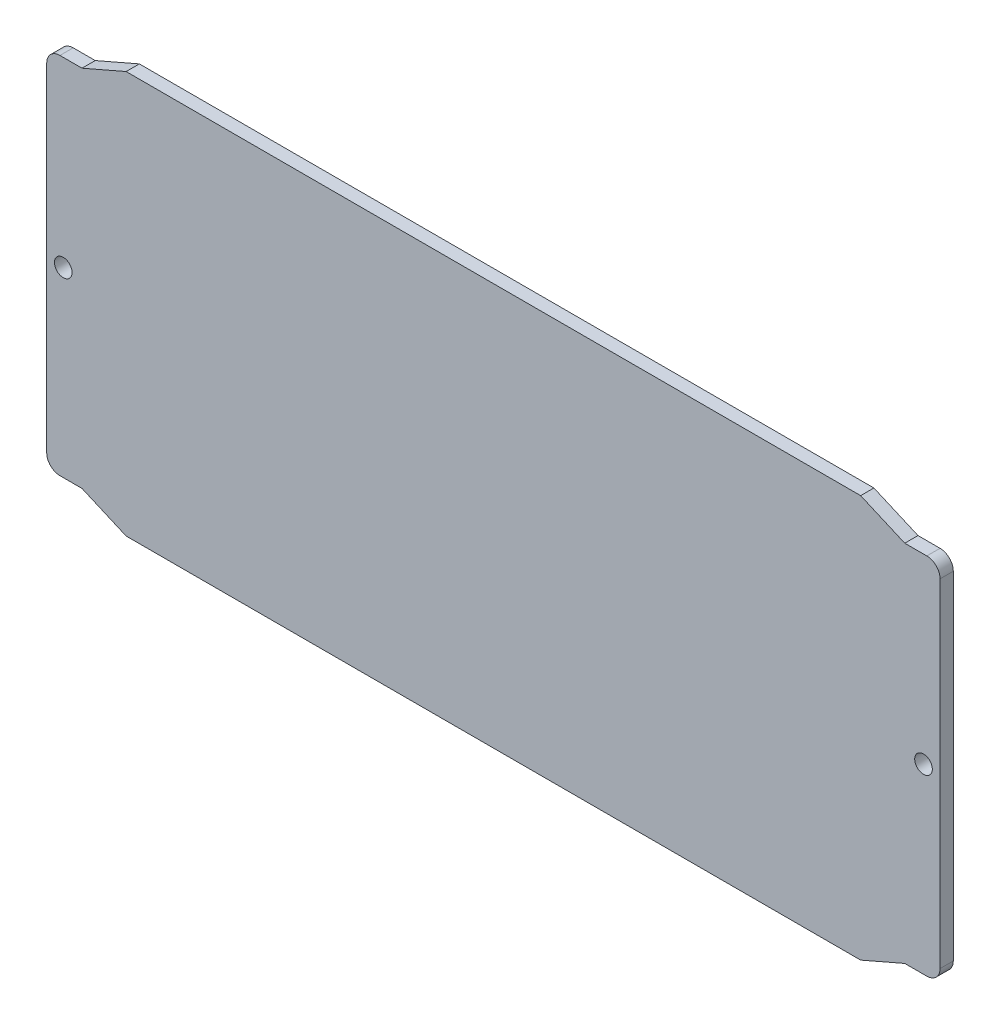
ISO-10303-21;
HEADER;
FILE_DESCRIPTION(('STEP AP214'),'2;1');
FILE_NAME('part.step','',(''),(''),'','','');
FILE_SCHEMA(('AUTOMOTIVE_DESIGN { 1 0 10303 214 1 1 1 1 }'));
ENDSEC;
DATA;
#1=APPLICATION_CONTEXT('core data for automotive mechanical design processes');
#2=APPLICATION_PROTOCOL_DEFINITION('international standard','automotive_design',2000,#1);
#3=PRODUCT_CONTEXT('',#1,'mechanical');
#4=PRODUCT('Part','Part','',(#3));
#5=PRODUCT_RELATED_PRODUCT_CATEGORY('part','',(#4));
#6=PRODUCT_DEFINITION_FORMATION('','',#4);
#7=PRODUCT_DEFINITION_CONTEXT('part definition',#1,'design');
#8=PRODUCT_DEFINITION('design','',#6,#7);
#9=PRODUCT_DEFINITION_SHAPE('','',#8);
#10=(LENGTH_UNIT() NAMED_UNIT(*) SI_UNIT(.MILLI.,.METRE.));
#11=(NAMED_UNIT(*) PLANE_ANGLE_UNIT() SI_UNIT($,.RADIAN.));
#12=(NAMED_UNIT(*) SI_UNIT($,.STERADIAN.) SOLID_ANGLE_UNIT());
#13=UNCERTAINTY_MEASURE_WITH_UNIT(LENGTH_MEASURE(1.E-05),#10,'distance_accuracy_value','');
#14=(GEOMETRIC_REPRESENTATION_CONTEXT(3) GLOBAL_UNCERTAINTY_ASSIGNED_CONTEXT((#13)) GLOBAL_UNIT_ASSIGNED_CONTEXT((#10,
#11,#12)) REPRESENTATION_CONTEXT('',''));
#15=CARTESIAN_POINT('',(0.,0.,0.));
#16=DIRECTION('',(0.,0.,1.));
#17=DIRECTION('',(1.,0.,0.));
#18=AXIS2_PLACEMENT_3D('',#15,#16,#17);
#19=CARTESIAN_POINT('',(3.,7.34000000000001,3.));
#20=DIRECTION('',(0.,0.,-1.));
#21=DIRECTION('',(-1.,0.,0.));
#22=AXIS2_PLACEMENT_3D('',#19,#20,#21);
#23=CYLINDRICAL_SURFACE('',#22,3.);
#24=CARTESIAN_POINT('',(3.,7.34000000000001,0.));
#25=DIRECTION('',(0.,0.,1.));
#26=DIRECTION('',(-1.,0.,0.));
#27=AXIS2_PLACEMENT_3D('',#24,#25,#26);
#28=CIRCLE('',#27,3.);
#29=CARTESIAN_POINT('',(0.,7.34000000000001,0.));
#30=VERTEX_POINT('',#29);
#31=CARTESIAN_POINT('',(3.,4.34000000000001,0.));
#32=VERTEX_POINT('',#31);
#33=EDGE_CURVE('E183',#30,#32,#28,.T.);
#34=ORIENTED_EDGE('',*,*,#33,.T.);
#35=DIRECTION('',(0.,0.,-1.));
#36=VECTOR('',#35,1.);
#37=CARTESIAN_POINT('',(3.,4.34000000000001,3.));
#38=LINE('',#37,#36);
#39=CARTESIAN_POINT('',(3.,4.34000000000001,3.));
#40=VERTEX_POINT('',#39);
#41=EDGE_CURVE('E12',#40,#32,#38,.T.);
#42=ORIENTED_EDGE('',*,*,#41,.F.);
#43=CARTESIAN_POINT('',(3.,7.34000000000001,3.));
#44=DIRECTION('',(0.,0.,1.));
#45=DIRECTION('',(-1.,0.,0.));
#46=AXIS2_PLACEMENT_3D('',#43,#44,#45);
#47=CIRCLE('',#46,3.);
#48=CARTESIAN_POINT('',(0.,7.34000000000001,3.));
#49=VERTEX_POINT('',#48);
#50=EDGE_CURVE('E201',#49,#40,#47,.T.);
#51=ORIENTED_EDGE('',*,*,#50,.F.);
#52=DIRECTION('',(0.,0.,-1.));
#53=VECTOR('',#52,1.);
#54=CARTESIAN_POINT('',(0.,7.34000000000001,3.));
#55=LINE('',#54,#53);
#56=EDGE_CURVE('E179',#49,#30,#55,.T.);
#57=ORIENTED_EDGE('',*,*,#56,.T.);
#58=EDGE_LOOP('',(#34,#42,#51,#57));
#59=FACE_BOUND('',#58,.T.);
#60=ADVANCED_FACE('F39',(#59),#23,.T.);
#61=CARTESIAN_POINT('',(8.,4.34000000000001,3.));
#62=DIRECTION('',(0.,1.,0.));
#63=DIRECTION('',(0.,0.,1.));
#64=AXIS2_PLACEMENT_3D('',#61,#62,#63);
#65=PLANE('',#64);
#66=DIRECTION('',(1.,0.,0.));
#67=VECTOR('',#66,1.);
#68=CARTESIAN_POINT('',(8.,4.34000000000001,0.));
#69=LINE('',#68,#67);
#70=CARTESIAN_POINT('',(8.,4.34000000000001,0.));
#71=VERTEX_POINT('',#70);
#72=EDGE_CURVE('E186',#32,#71,#69,.T.);
#73=ORIENTED_EDGE('',*,*,#72,.T.);
#74=DIRECTION('',(0.,0.,-1.));
#75=VECTOR('',#74,1.);
#76=CARTESIAN_POINT('',(8.,4.34000000000001,3.));
#77=LINE('',#76,#75);
#78=CARTESIAN_POINT('',(8.,4.34000000000001,3.));
#79=VERTEX_POINT('',#78);
#80=EDGE_CURVE('E47',#79,#71,#77,.T.);
#81=ORIENTED_EDGE('',*,*,#80,.F.);
#82=DIRECTION('',(1.,0.,0.));
#83=VECTOR('',#82,1.);
#84=CARTESIAN_POINT('',(8.,4.34000000000001,3.));
#85=LINE('',#84,#83);
#86=EDGE_CURVE('E122',#40,#79,#85,.T.);
#87=ORIENTED_EDGE('',*,*,#86,.F.);
#88=ORIENTED_EDGE('',*,*,#41,.T.);
#89=EDGE_LOOP('',(#73,#81,#87,#88));
#90=FACE_BOUND('',#89,.T.);
#91=ADVANCED_FACE('F316',(#90),#65,.F.);
#92=CARTESIAN_POINT('',(18.,0.,3.));
#93=DIRECTION('',(0.398122248208909,0.917332369144948,0.));
#94=DIRECTION('',(-0.917332369144949,0.398122248208909,0.));
#95=AXIS2_PLACEMENT_3D('',#92,#93,#94);
#96=PLANE('',#95);
#97=DIRECTION('',(0.917332369144949,-0.398122248208909,0.));
#98=VECTOR('',#97,1.);
#99=CARTESIAN_POINT('',(18.,0.,0.));
#100=LINE('',#99,#98);
#101=CARTESIAN_POINT('',(18.,0.,0.));
#102=VERTEX_POINT('',#101);
#103=EDGE_CURVE('E242',#71,#102,#100,.T.);
#104=ORIENTED_EDGE('',*,*,#103,.T.);
#105=DIRECTION('',(0.,0.,-1.));
#106=VECTOR('',#105,1.);
#107=CARTESIAN_POINT('',(18.,0.,3.));
#108=LINE('',#107,#106);
#109=CARTESIAN_POINT('',(18.,0.,3.));
#110=VERTEX_POINT('',#109);
#111=EDGE_CURVE('E234',#110,#102,#108,.T.);
#112=ORIENTED_EDGE('',*,*,#111,.F.);
#113=DIRECTION('',(0.917332369144949,-0.398122248208909,0.));
#114=VECTOR('',#113,1.);
#115=CARTESIAN_POINT('',(18.,0.,3.));
#116=LINE('',#115,#114);
#117=EDGE_CURVE('E243',#79,#110,#116,.T.);
#118=ORIENTED_EDGE('',*,*,#117,.F.);
#119=ORIENTED_EDGE('',*,*,#80,.T.);
#120=EDGE_LOOP('',(#104,#112,#118,#119));
#121=FACE_BOUND('',#120,.T.);
#122=ADVANCED_FACE('F240',(#121),#96,.F.);
#123=CARTESIAN_POINT('',(184.5,0.,3.));
#124=DIRECTION('',(0.,1.,0.));
#125=DIRECTION('',(-1.,0.,0.));
#126=AXIS2_PLACEMENT_3D('',#123,#124,#125);
#127=PLANE('',#126);
#128=DIRECTION('',(1.,0.,0.));
#129=VECTOR('',#128,1.);
#130=CARTESIAN_POINT('',(184.5,0.,0.));
#131=LINE('',#130,#129);
#132=CARTESIAN_POINT('',(184.5,0.,0.));
#133=VERTEX_POINT('',#132);
#134=EDGE_CURVE('E249',#102,#133,#131,.T.);
#135=ORIENTED_EDGE('',*,*,#134,.T.);
#136=DIRECTION('',(0.,0.,-1.));
#137=VECTOR('',#136,1.);
#138=CARTESIAN_POINT('',(184.5,0.,3.));
#139=LINE('',#138,#137);
#140=CARTESIAN_POINT('',(184.5,0.,3.));
#141=VERTEX_POINT('',#140);
#142=EDGE_CURVE('E231',#141,#133,#139,.T.);
#143=ORIENTED_EDGE('',*,*,#142,.F.);
#144=DIRECTION('',(1.,0.,0.));
#145=VECTOR('',#144,1.);
#146=CARTESIAN_POINT('',(184.5,0.,3.));
#147=LINE('',#146,#145);
#148=EDGE_CURVE('E545',#110,#141,#147,.T.);
#149=ORIENTED_EDGE('',*,*,#148,.F.);
#150=ORIENTED_EDGE('',*,*,#111,.T.);
#151=EDGE_LOOP('',(#135,#143,#149,#150));
#152=FACE_BOUND('',#151,.T.);
#153=ADVANCED_FACE('F323',(#152),#127,.F.);
#154=CARTESIAN_POINT('',(194.5,4.34000000000014,3.));
#155=DIRECTION('',(-0.39812224820892,0.917332369144944,0.));
#156=DIRECTION('',(-0.917332369144944,-0.39812224820892,0.));
#157=AXIS2_PLACEMENT_3D('',#154,#155,#156);
#158=PLANE('',#157);
#159=DIRECTION('',(0.917332369144944,0.39812224820892,0.));
#160=VECTOR('',#159,1.);
#161=CARTESIAN_POINT('',(194.5,4.34000000000014,0.));
#162=LINE('',#161,#160);
#163=CARTESIAN_POINT('',(194.5,4.34000000000014,0.));
#164=VERTEX_POINT('',#163);
#165=EDGE_CURVE('E250',#133,#164,#162,.T.);
#166=ORIENTED_EDGE('',*,*,#165,.T.);
#167=DIRECTION('',(0.,0.,-1.));
#168=VECTOR('',#167,1.);
#169=CARTESIAN_POINT('',(194.5,4.34000000000014,3.));
#170=LINE('',#169,#168);
#171=CARTESIAN_POINT('',(194.5,4.34000000000014,3.));
#172=VERTEX_POINT('',#171);
#173=EDGE_CURVE('E228',#172,#164,#170,.T.);
#174=ORIENTED_EDGE('',*,*,#173,.F.);
#175=DIRECTION('',(0.917332369144944,0.39812224820892,0.));
#176=VECTOR('',#175,1.);
#177=CARTESIAN_POINT('',(194.5,4.34000000000014,3.));
#178=LINE('',#177,#176);
#179=EDGE_CURVE('E547',#141,#172,#178,.T.);
#180=ORIENTED_EDGE('',*,*,#179,.F.);
#181=ORIENTED_EDGE('',*,*,#142,.T.);
#182=EDGE_LOOP('',(#166,#174,#180,#181));
#183=FACE_BOUND('',#182,.T.);
#184=ADVANCED_FACE('F328',(#183),#158,.F.);
#185=CARTESIAN_POINT('',(199.5,4.34000000000005,3.));
#186=DIRECTION('',(0.,1.,0.));
#187=DIRECTION('',(-1.,0.,0.));
#188=AXIS2_PLACEMENT_3D('',#185,#186,#187);
#189=PLANE('',#188);
#190=DIRECTION('',(1.,0.,0.));
#191=VECTOR('',#190,1.);
#192=CARTESIAN_POINT('',(199.5,4.34000000000005,0.));
#193=LINE('',#192,#191);
#194=CARTESIAN_POINT('',(199.5,4.34000000000005,0.));
#195=VERTEX_POINT('',#194);
#196=EDGE_CURVE('E261',#164,#195,#193,.T.);
#197=ORIENTED_EDGE('',*,*,#196,.T.);
#198=DIRECTION('',(0.,0.,-1.));
#199=VECTOR('',#198,1.);
#200=CARTESIAN_POINT('',(199.5,4.34000000000005,3.));
#201=LINE('',#200,#199);
#202=CARTESIAN_POINT('',(199.5,4.34000000000005,3.));
#203=VERTEX_POINT('',#202);
#204=EDGE_CURVE('E225',#203,#195,#201,.T.);
#205=ORIENTED_EDGE('',*,*,#204,.F.);
#206=DIRECTION('',(1.,0.,0.));
#207=VECTOR('',#206,1.);
#208=CARTESIAN_POINT('',(199.5,4.34000000000005,3.));
#209=LINE('',#208,#207);
#210=EDGE_CURVE('E549',#172,#203,#209,.T.);
#211=ORIENTED_EDGE('',*,*,#210,.F.);
#212=ORIENTED_EDGE('',*,*,#173,.T.);
#213=EDGE_LOOP('',(#197,#205,#211,#212));
#214=FACE_BOUND('',#213,.T.);
#215=ADVANCED_FACE('F332',(#214),#189,.F.);
#216=CARTESIAN_POINT('',(199.5,7.34000000000005,3.));
#217=DIRECTION('',(0.,0.,-1.));
#218=DIRECTION('',(-1.,0.,0.));
#219=AXIS2_PLACEMENT_3D('',#216,#217,#218);
#220=CYLINDRICAL_SURFACE('',#219,3.);
#221=CARTESIAN_POINT('',(199.5,7.34000000000005,0.));
#222=DIRECTION('',(0.,0.,1.));
#223=DIRECTION('',(-1.,0.,0.));
#224=AXIS2_PLACEMENT_3D('',#221,#222,#223);
#225=CIRCLE('',#224,3.);
#226=CARTESIAN_POINT('',(202.5,7.34000000000005,0.));
#227=VERTEX_POINT('',#226);
#228=EDGE_CURVE('E264',#195,#227,#225,.T.);
#229=ORIENTED_EDGE('',*,*,#228,.T.);
#230=DIRECTION('',(0.,0.,-1.));
#231=VECTOR('',#230,1.);
#232=CARTESIAN_POINT('',(202.5,7.34000000000005,3.));
#233=LINE('',#232,#231);
#234=CARTESIAN_POINT('',(202.5,7.34000000000005,3.));
#235=VERTEX_POINT('',#234);
#236=EDGE_CURVE('E222',#235,#227,#233,.T.);
#237=ORIENTED_EDGE('',*,*,#236,.F.);
#238=CARTESIAN_POINT('',(199.5,7.34000000000005,3.));
#239=DIRECTION('',(0.,0.,1.));
#240=DIRECTION('',(-1.,0.,0.));
#241=AXIS2_PLACEMENT_3D('',#238,#239,#240);
#242=CIRCLE('',#241,3.);
#243=EDGE_CURVE('E551',#203,#235,#242,.T.);
#244=ORIENTED_EDGE('',*,*,#243,.F.);
#245=ORIENTED_EDGE('',*,*,#204,.T.);
#246=EDGE_LOOP('',(#229,#237,#244,#245));
#247=FACE_BOUND('',#246,.T.);
#248=ADVANCED_FACE('F336',(#247),#220,.T.);
#249=CARTESIAN_POINT('',(202.5,83.8400000000008,3.));
#250=DIRECTION('',(-1.,0.,0.));
#251=DIRECTION('',(0.,0.,1.));
#252=AXIS2_PLACEMENT_3D('',#249,#250,#251);
#253=PLANE('',#252);
#254=DIRECTION('',(0.,1.,0.));
#255=VECTOR('',#254,1.);
#256=CARTESIAN_POINT('',(202.5,83.8400000000008,0.));
#257=LINE('',#256,#255);
#258=CARTESIAN_POINT('',(202.5,83.8400000000008,0.));
#259=VERTEX_POINT('',#258);
#260=EDGE_CURVE('E267',#227,#259,#257,.T.);
#261=ORIENTED_EDGE('',*,*,#260,.T.);
#262=DIRECTION('',(0.,0.,-1.));
#263=VECTOR('',#262,1.);
#264=CARTESIAN_POINT('',(202.5,83.8400000000008,3.));
#265=LINE('',#264,#263);
#266=CARTESIAN_POINT('',(202.5,83.8400000000008,3.));
#267=VERTEX_POINT('',#266);
#268=EDGE_CURVE('E219',#267,#259,#265,.T.);
#269=ORIENTED_EDGE('',*,*,#268,.F.);
#270=DIRECTION('',(0.,1.,0.));
#271=VECTOR('',#270,1.);
#272=CARTESIAN_POINT('',(202.5,83.8400000000008,3.));
#273=LINE('',#272,#271);
#274=EDGE_CURVE('E553',#235,#267,#273,.T.);
#275=ORIENTED_EDGE('',*,*,#274,.F.);
#276=ORIENTED_EDGE('',*,*,#236,.T.);
#277=EDGE_LOOP('',(#261,#269,#275,#276));
#278=FACE_BOUND('',#277,.T.);
#279=ADVANCED_FACE('F340',(#278),#253,.F.);
#280=CARTESIAN_POINT('',(199.5,83.8400000000008,3.));
#281=DIRECTION('',(0.,0.,-1.));
#282=DIRECTION('',(-1.,0.,0.));
#283=AXIS2_PLACEMENT_3D('',#280,#281,#282);
#284=CYLINDRICAL_SURFACE('',#283,3.);
#285=CARTESIAN_POINT('',(199.5,83.8400000000008,0.));
#286=DIRECTION('',(0.,0.,1.));
#287=DIRECTION('',(-1.,0.,0.));
#288=AXIS2_PLACEMENT_3D('',#285,#286,#287);
#289=CIRCLE('',#288,3.);
#290=CARTESIAN_POINT('',(199.5,86.8400000000008,0.));
#291=VERTEX_POINT('',#290);
#292=EDGE_CURVE('E275',#259,#291,#289,.T.);
#293=ORIENTED_EDGE('',*,*,#292,.T.);
#294=DIRECTION('',(0.,0.,-1.));
#295=VECTOR('',#294,1.);
#296=CARTESIAN_POINT('',(199.5,86.8400000000008,3.));
#297=LINE('',#296,#295);
#298=CARTESIAN_POINT('',(199.5,86.8400000000008,3.));
#299=VERTEX_POINT('',#298);
#300=EDGE_CURVE('E216',#299,#291,#297,.T.);
#301=ORIENTED_EDGE('',*,*,#300,.F.);
#302=CARTESIAN_POINT('',(199.5,83.8400000000008,3.));
#303=DIRECTION('',(0.,0.,1.));
#304=DIRECTION('',(-1.,0.,0.));
#305=AXIS2_PLACEMENT_3D('',#302,#303,#304);
#306=CIRCLE('',#305,3.);
#307=EDGE_CURVE('E555',#267,#299,#306,.T.);
#308=ORIENTED_EDGE('',*,*,#307,.F.);
#309=ORIENTED_EDGE('',*,*,#268,.T.);
#310=EDGE_LOOP('',(#293,#301,#308,#309));
#311=FACE_BOUND('',#310,.T.);
#312=ADVANCED_FACE('F344',(#311),#284,.T.);
#313=CARTESIAN_POINT('',(194.5,86.8400000000008,3.));
#314=DIRECTION('',(0.,-1.,0.));
#315=DIRECTION('',(0.,0.,-1.));
#316=AXIS2_PLACEMENT_3D('',#313,#314,#315);
#317=PLANE('',#316);
#318=DIRECTION('',(-1.,0.,0.));
#319=VECTOR('',#318,1.);
#320=CARTESIAN_POINT('',(194.5,86.8400000000008,0.));
#321=LINE('',#320,#319);
#322=CARTESIAN_POINT('',(194.5,86.8400000000008,0.));
#323=VERTEX_POINT('',#322);
#324=EDGE_CURVE('E277',#291,#323,#321,.T.);
#325=ORIENTED_EDGE('',*,*,#324,.T.);
#326=DIRECTION('',(0.,0.,-1.));
#327=VECTOR('',#326,1.);
#328=CARTESIAN_POINT('',(194.5,86.8400000000008,3.));
#329=LINE('',#328,#327);
#330=CARTESIAN_POINT('',(194.5,86.8400000000008,3.));
#331=VERTEX_POINT('',#330);
#332=EDGE_CURVE('E213',#331,#323,#329,.T.);
#333=ORIENTED_EDGE('',*,*,#332,.F.);
#334=DIRECTION('',(-1.,0.,0.));
#335=VECTOR('',#334,1.);
#336=CARTESIAN_POINT('',(194.5,86.8400000000008,3.));
#337=LINE('',#336,#335);
#338=EDGE_CURVE('E557',#299,#331,#337,.T.);
#339=ORIENTED_EDGE('',*,*,#338,.F.);
#340=ORIENTED_EDGE('',*,*,#300,.T.);
#341=EDGE_LOOP('',(#325,#333,#339,#340));
#342=FACE_BOUND('',#341,.T.);
#343=ADVANCED_FACE('F348',(#342),#317,.F.);
#344=CARTESIAN_POINT('',(184.5,91.18,3.));
#345=DIRECTION('',(-0.398122248208849,-0.917332369144974,0.));
#346=DIRECTION('',(0.917332369144974,-0.398122248208849,0.));
#347=AXIS2_PLACEMENT_3D('',#344,#345,#346);
#348=PLANE('',#347);
#349=DIRECTION('',(-0.917332369144974,0.398122248208849,0.));
#350=VECTOR('',#349,1.);
#351=CARTESIAN_POINT('',(184.5,91.18,0.));
#352=LINE('',#351,#350);
#353=CARTESIAN_POINT('',(184.5,91.18,0.));
#354=VERTEX_POINT('',#353);
#355=EDGE_CURVE('E280',#323,#354,#352,.T.);
#356=ORIENTED_EDGE('',*,*,#355,.T.);
#357=DIRECTION('',(0.,0.,-1.));
#358=VECTOR('',#357,1.);
#359=CARTESIAN_POINT('',(184.5,91.18,3.));
#360=LINE('',#359,#358);
#361=CARTESIAN_POINT('',(184.5,91.18,3.));
#362=VERTEX_POINT('',#361);
#363=EDGE_CURVE('E210',#362,#354,#360,.T.);
#364=ORIENTED_EDGE('',*,*,#363,.F.);
#365=DIRECTION('',(-0.917332369144974,0.398122248208849,0.));
#366=VECTOR('',#365,1.);
#367=CARTESIAN_POINT('',(184.5,91.18,3.));
#368=LINE('',#367,#366);
#369=EDGE_CURVE('E559',#331,#362,#368,.T.);
#370=ORIENTED_EDGE('',*,*,#369,.F.);
#371=ORIENTED_EDGE('',*,*,#332,.T.);
#372=EDGE_LOOP('',(#356,#364,#370,#371));
#373=FACE_BOUND('',#372,.T.);
#374=ADVANCED_FACE('F352',(#373),#348,.F.);
#375=CARTESIAN_POINT('',(18.,91.18,3.));
#376=DIRECTION('',(0.,-1.,0.));
#377=DIRECTION('',(1.,0.,0.));
#378=AXIS2_PLACEMENT_3D('',#375,#376,#377);
#379=PLANE('',#378);
#380=DIRECTION('',(-1.,0.,0.));
#381=VECTOR('',#380,1.);
#382=CARTESIAN_POINT('',(18.,91.18,0.));
#383=LINE('',#382,#381);
#384=CARTESIAN_POINT('',(18.,91.18,0.));
#385=VERTEX_POINT('',#384);
#386=EDGE_CURVE('E283',#354,#385,#383,.T.);
#387=ORIENTED_EDGE('',*,*,#386,.T.);
#388=DIRECTION('',(0.,0.,-1.));
#389=VECTOR('',#388,1.);
#390=CARTESIAN_POINT('',(18.,91.18,3.));
#391=LINE('',#390,#389);
#392=CARTESIAN_POINT('',(18.,91.18,3.));
#393=VERTEX_POINT('',#392);
#394=EDGE_CURVE('E207',#393,#385,#391,.T.);
#395=ORIENTED_EDGE('',*,*,#394,.F.);
#396=DIRECTION('',(-1.,0.,0.));
#397=VECTOR('',#396,1.);
#398=CARTESIAN_POINT('',(18.,91.18,3.));
#399=LINE('',#398,#397);
#400=EDGE_CURVE('E561',#362,#393,#399,.T.);
#401=ORIENTED_EDGE('',*,*,#400,.F.);
#402=ORIENTED_EDGE('',*,*,#363,.T.);
#403=EDGE_LOOP('',(#387,#395,#401,#402));
#404=FACE_BOUND('',#403,.T.);
#405=ADVANCED_FACE('F296',(#404),#379,.F.);
#406=CARTESIAN_POINT('',(7.99999999999998,86.84,3.));
#407=DIRECTION('',(0.398122248208909,-0.917332369144949,0.));
#408=DIRECTION('',(0.917332369144949,0.398122248208909,0.));
#409=AXIS2_PLACEMENT_3D('',#406,#407,#408);
#410=PLANE('',#409);
#411=DIRECTION('',(-0.917332369144949,-0.398122248208909,0.));
#412=VECTOR('',#411,1.);
#413=CARTESIAN_POINT('',(7.99999999999998,86.84,0.));
#414=LINE('',#413,#412);
#415=CARTESIAN_POINT('',(7.99999999999998,86.84,0.));
#416=VERTEX_POINT('',#415);
#417=EDGE_CURVE('E288',#385,#416,#414,.T.);
#418=ORIENTED_EDGE('',*,*,#417,.T.);
#419=DIRECTION('',(0.,0.,-1.));
#420=VECTOR('',#419,1.);
#421=CARTESIAN_POINT('',(7.99999999999998,86.84,3.));
#422=LINE('',#421,#420);
#423=CARTESIAN_POINT('',(7.99999999999998,86.84,3.));
#424=VERTEX_POINT('',#423);
#425=EDGE_CURVE('E174',#424,#416,#422,.T.);
#426=ORIENTED_EDGE('',*,*,#425,.F.);
#427=DIRECTION('',(-0.917332369144949,-0.398122248208909,0.));
#428=VECTOR('',#427,1.);
#429=CARTESIAN_POINT('',(7.99999999999998,86.84,3.));
#430=LINE('',#429,#428);
#431=EDGE_CURVE('E165',#393,#424,#430,.T.);
#432=ORIENTED_EDGE('',*,*,#431,.F.);
#433=ORIENTED_EDGE('',*,*,#394,.T.);
#434=EDGE_LOOP('',(#418,#426,#432,#433));
#435=FACE_BOUND('',#434,.T.);
#436=ADVANCED_FACE('F300',(#435),#410,.F.);
#437=CARTESIAN_POINT('',(2.99999999999998,86.84,3.));
#438=DIRECTION('',(0.,-1.,0.));
#439=DIRECTION('',(0.,0.,-1.));
#440=AXIS2_PLACEMENT_3D('',#437,#438,#439);
#441=PLANE('',#440);
#442=DIRECTION('',(-1.,0.,0.));
#443=VECTOR('',#442,1.);
#444=CARTESIAN_POINT('',(2.99999999999998,86.84,0.));
#445=LINE('',#444,#443);
#446=CARTESIAN_POINT('',(2.99999999999998,86.84,0.));
#447=VERTEX_POINT('',#446);
#448=EDGE_CURVE('E173',#416,#447,#445,.T.);
#449=ORIENTED_EDGE('',*,*,#448,.T.);
#450=DIRECTION('',(0.,0.,-1.));
#451=VECTOR('',#450,1.);
#452=CARTESIAN_POINT('',(2.99999999999998,86.84,3.));
#453=LINE('',#452,#451);
#454=CARTESIAN_POINT('',(2.99999999999998,86.84,3.));
#455=VERTEX_POINT('',#454);
#456=EDGE_CURVE('E170',#455,#447,#453,.T.);
#457=ORIENTED_EDGE('',*,*,#456,.F.);
#458=DIRECTION('',(-1.,0.,0.));
#459=VECTOR('',#458,1.);
#460=CARTESIAN_POINT('',(2.99999999999998,86.84,3.));
#461=LINE('',#460,#459);
#462=EDGE_CURVE('E159',#424,#455,#461,.T.);
#463=ORIENTED_EDGE('',*,*,#462,.F.);
#464=ORIENTED_EDGE('',*,*,#425,.T.);
#465=EDGE_LOOP('',(#449,#457,#463,#464));
#466=FACE_BOUND('',#465,.T.);
#467=ADVANCED_FACE('F171',(#466),#441,.F.);
#468=CARTESIAN_POINT('',(2.99999999999998,83.84,3.));
#469=DIRECTION('',(0.,0.,-1.));
#470=DIRECTION('',(-1.,0.,0.));
#471=AXIS2_PLACEMENT_3D('',#468,#469,#470);
#472=CYLINDRICAL_SURFACE('',#471,2.99999999999999);
#473=CARTESIAN_POINT('',(2.99999999999998,83.84,0.));
#474=DIRECTION('',(0.,0.,1.));
#475=DIRECTION('',(-1.,0.,0.));
#476=AXIS2_PLACEMENT_3D('',#473,#474,#475);
#477=CIRCLE('',#476,2.99999999999999);
#478=CARTESIAN_POINT('',(0.,83.84,0.));
#479=VERTEX_POINT('',#478);
#480=EDGE_CURVE('E108',#447,#479,#477,.T.);
#481=ORIENTED_EDGE('',*,*,#480,.T.);
#482=DIRECTION('',(0.,0.,-1.));
#483=VECTOR('',#482,1.);
#484=CARTESIAN_POINT('',(0.,83.84,3.));
#485=LINE('',#484,#483);
#486=CARTESIAN_POINT('',(0.,83.84,3.));
#487=VERTEX_POINT('',#486);
#488=EDGE_CURVE('E175',#487,#479,#485,.T.);
#489=ORIENTED_EDGE('',*,*,#488,.F.);
#490=CARTESIAN_POINT('',(2.99999999999998,83.84,3.));
#491=DIRECTION('',(0.,0.,1.));
#492=DIRECTION('',(-1.,0.,0.));
#493=AXIS2_PLACEMENT_3D('',#490,#491,#492);
#494=CIRCLE('',#493,2.99999999999999);
#495=EDGE_CURVE('E163',#455,#487,#494,.T.);
#496=ORIENTED_EDGE('',*,*,#495,.F.);
#497=ORIENTED_EDGE('',*,*,#456,.T.);
#498=EDGE_LOOP('',(#481,#489,#496,#497));
#499=FACE_BOUND('',#498,.T.);
#500=ADVANCED_FACE('F177',(#499),#472,.T.);
#501=CARTESIAN_POINT('',(0.,7.34000000000001,3.));
#502=DIRECTION('',(1.,0.,0.));
#503=DIRECTION('',(0.,1.,0.));
#504=AXIS2_PLACEMENT_3D('',#501,#502,#503);
#505=PLANE('',#504);
#506=DIRECTION('',(0.,-1.,0.));
#507=VECTOR('',#506,1.);
#508=CARTESIAN_POINT('',(0.,7.34000000000001,0.));
#509=LINE('',#508,#507);
#510=EDGE_CURVE('E114',#479,#30,#509,.T.);
#511=ORIENTED_EDGE('',*,*,#510,.T.);
#512=ORIENTED_EDGE('',*,*,#56,.F.);
#513=DIRECTION('',(0.,-1.,0.));
#514=VECTOR('',#513,1.);
#515=CARTESIAN_POINT('',(0.,7.34000000000001,3.));
#516=LINE('',#515,#514);
#517=EDGE_CURVE('E55',#487,#49,#516,.T.);
#518=ORIENTED_EDGE('',*,*,#517,.F.);
#519=ORIENTED_EDGE('',*,*,#488,.T.);
#520=EDGE_LOOP('',(#511,#512,#518,#519));
#521=FACE_BOUND('',#520,.T.);
#522=ADVANCED_FACE('F304',(#521),#505,.F.);
#523=CARTESIAN_POINT('',(3.,7.34000000000001,3.));
#524=DIRECTION('',(0.,0.,-1.));
#525=DIRECTION('',(-1.,0.,0.));
#526=AXIS2_PLACEMENT_3D('',#523,#524,#525);
#527=PLANE('',#526);
#528=CARTESIAN_POINT('',(3.74999999999998,45.5900000000005,3.));
#529=DIRECTION('',(0.,0.,1.));
#530=DIRECTION('',(1.,0.,0.));
#531=AXIS2_PLACEMENT_3D('',#528,#529,#530);
#532=CIRCLE('',#531,1.99999999999999);
#533=CARTESIAN_POINT('',(5.74999999999996,45.5900000000005,3.));
#534=VERTEX_POINT('',#533);
#535=EDGE_CURVE('E532',#534,#534,#532,.T.);
#536=ORIENTED_EDGE('',*,*,#535,.F.);
#537=EDGE_LOOP('',(#536));
#538=FACE_BOUND('',#537,.T.);
#539=CARTESIAN_POINT('',(198.75,45.5900000000004,3.));
#540=DIRECTION('',(0.,0.,1.));
#541=DIRECTION('',(1.,0.,0.));
#542=AXIS2_PLACEMENT_3D('',#539,#540,#541);
#543=CIRCLE('',#542,1.99999999999997);
#544=CARTESIAN_POINT('',(200.75,45.5900000000004,3.));
#545=VERTEX_POINT('',#544);
#546=EDGE_CURVE('E534',#545,#545,#543,.T.);
#547=ORIENTED_EDGE('',*,*,#546,.F.);
#548=EDGE_LOOP('',(#547));
#549=FACE_BOUND('',#548,.T.);
#550=ORIENTED_EDGE('',*,*,#50,.T.);
#551=ORIENTED_EDGE('',*,*,#86,.T.);
#552=ORIENTED_EDGE('',*,*,#117,.T.);
#553=ORIENTED_EDGE('',*,*,#148,.T.);
#554=ORIENTED_EDGE('',*,*,#179,.T.);
#555=ORIENTED_EDGE('',*,*,#210,.T.);
#556=ORIENTED_EDGE('',*,*,#243,.T.);
#557=ORIENTED_EDGE('',*,*,#274,.T.);
#558=ORIENTED_EDGE('',*,*,#307,.T.);
#559=ORIENTED_EDGE('',*,*,#338,.T.);
#560=ORIENTED_EDGE('',*,*,#369,.T.);
#561=ORIENTED_EDGE('',*,*,#400,.T.);
#562=ORIENTED_EDGE('',*,*,#431,.T.);
#563=ORIENTED_EDGE('',*,*,#462,.T.);
#564=ORIENTED_EDGE('',*,*,#495,.T.);
#565=ORIENTED_EDGE('',*,*,#517,.T.);
#566=EDGE_LOOP('',(#550,#551,#552,#553,#554,#555,#556,#557,#558,#559,#560,#561,#562,#563,#564,#565));
#567=FACE_BOUND('',#566,.T.);
#568=ADVANCED_FACE('F161',(#538,#549,#567),#527,.F.);
#569=CARTESIAN_POINT('',(3.,7.34000000000001,0.));
#570=DIRECTION('',(0.,0.,-1.));
#571=DIRECTION('',(-1.,0.,0.));
#572=AXIS2_PLACEMENT_3D('',#569,#570,#571);
#573=PLANE('',#572);
#574=CARTESIAN_POINT('',(3.74999999999998,45.5900000000005,0.));
#575=DIRECTION('',(0.,0.,1.));
#576=DIRECTION('',(1.,0.,0.));
#577=AXIS2_PLACEMENT_3D('',#574,#575,#576);
#578=CIRCLE('',#577,2.);
#579=CARTESIAN_POINT('',(5.74999999999997,45.5900000000005,0.));
#580=VERTEX_POINT('',#579);
#581=EDGE_CURVE('E529',#580,#580,#578,.T.);
#582=ORIENTED_EDGE('',*,*,#581,.T.);
#583=EDGE_LOOP('',(#582));
#584=FACE_BOUND('',#583,.T.);
#585=CARTESIAN_POINT('',(198.75,45.5900000000004,0.));
#586=DIRECTION('',(0.,0.,1.));
#587=DIRECTION('',(1.,0.,0.));
#588=AXIS2_PLACEMENT_3D('',#585,#586,#587);
#589=CIRCLE('',#588,2.);
#590=CARTESIAN_POINT('',(200.75,45.5900000000004,0.));
#591=VERTEX_POINT('',#590);
#592=EDGE_CURVE('E187',#591,#591,#589,.T.);
#593=ORIENTED_EDGE('',*,*,#592,.T.);
#594=EDGE_LOOP('',(#593));
#595=FACE_BOUND('',#594,.T.);
#596=ORIENTED_EDGE('',*,*,#33,.F.);
#597=ORIENTED_EDGE('',*,*,#510,.F.);
#598=ORIENTED_EDGE('',*,*,#480,.F.);
#599=ORIENTED_EDGE('',*,*,#448,.F.);
#600=ORIENTED_EDGE('',*,*,#417,.F.);
#601=ORIENTED_EDGE('',*,*,#386,.F.);
#602=ORIENTED_EDGE('',*,*,#355,.F.);
#603=ORIENTED_EDGE('',*,*,#324,.F.);
#604=ORIENTED_EDGE('',*,*,#292,.F.);
#605=ORIENTED_EDGE('',*,*,#260,.F.);
#606=ORIENTED_EDGE('',*,*,#228,.F.);
#607=ORIENTED_EDGE('',*,*,#196,.F.);
#608=ORIENTED_EDGE('',*,*,#165,.F.);
#609=ORIENTED_EDGE('',*,*,#134,.F.);
#610=ORIENTED_EDGE('',*,*,#103,.F.);
#611=ORIENTED_EDGE('',*,*,#72,.F.);
#612=EDGE_LOOP('',(#596,#597,#598,#599,#600,#601,#602,#603,#604,#605,#606,#607,#608,#609,#610,#611));
#613=FACE_BOUND('',#612,.T.);
#614=ADVANCED_FACE('F247',(#584,#595,#613),#573,.T.);
#615=CARTESIAN_POINT('',(198.75,45.5900000000004,3.));
#616=DIRECTION('',(0.,0.,1.));
#617=DIRECTION('',(1.,0.,0.));
#618=AXIS2_PLACEMENT_3D('',#615,#616,#617);
#619=CYLINDRICAL_SURFACE('',#618,1.99999999999999);
#620=ORIENTED_EDGE('',*,*,#592,.F.);
#621=EDGE_LOOP('',(#620));
#622=FACE_BOUND('',#621,.T.);
#623=ORIENTED_EDGE('',*,*,#546,.T.);
#624=EDGE_LOOP('',(#623));
#625=FACE_BOUND('',#624,.T.);
#626=ADVANCED_FACE('F392',(#622,#625),#619,.F.);
#627=CARTESIAN_POINT('',(3.74999999999998,45.5900000000005,3.));
#628=DIRECTION('',(0.,0.,1.));
#629=DIRECTION('',(1.,0.,0.));
#630=AXIS2_PLACEMENT_3D('',#627,#628,#629);
#631=CYLINDRICAL_SURFACE('',#630,1.99999999999999);
#632=ORIENTED_EDGE('',*,*,#581,.F.);
#633=EDGE_LOOP('',(#632));
#634=FACE_BOUND('',#633,.T.);
#635=ORIENTED_EDGE('',*,*,#535,.T.);
#636=EDGE_LOOP('',(#635));
#637=FACE_BOUND('',#636,.T.);
#638=ADVANCED_FACE('F402',(#634,#637),#631,.F.);
#639=CLOSED_SHELL('',(#60,#91,#122,#153,#184,#215,#248,#279,#312,#343,#374,#405,#436,#467,#500,
#522,#568,#614,#626,#638));
#640=MANIFOLD_SOLID_BREP('B2',#639);
#641=ADVANCED_BREP_SHAPE_REPRESENTATION('',(#18,#640),#14);
#642=SHAPE_DEFINITION_REPRESENTATION(#9,#641);
ENDSEC;
END-ISO-10303-21;
